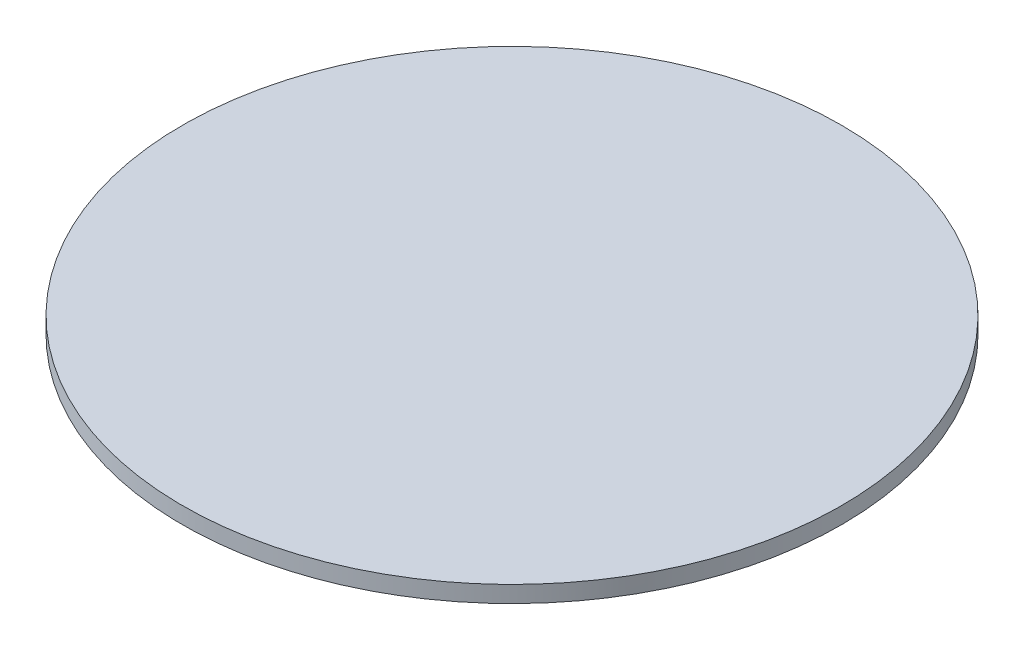
ISO-10303-21;
HEADER;
FILE_DESCRIPTION(('STEP AP214'),'2;1');
FILE_NAME('part.step','',(''),(''),'','','');
FILE_SCHEMA(('AUTOMOTIVE_DESIGN { 1 0 10303 214 1 1 1 1 }'));
ENDSEC;
DATA;
#1=APPLICATION_CONTEXT('core data for automotive mechanical design processes');
#2=APPLICATION_PROTOCOL_DEFINITION('international standard','automotive_design',2000,#1);
#3=PRODUCT_CONTEXT('',#1,'mechanical');
#4=PRODUCT('Part','Part','',(#3));
#5=PRODUCT_RELATED_PRODUCT_CATEGORY('part','',(#4));
#6=PRODUCT_DEFINITION_FORMATION('','',#4);
#7=PRODUCT_DEFINITION_CONTEXT('part definition',#1,'design');
#8=PRODUCT_DEFINITION('design','',#6,#7);
#9=PRODUCT_DEFINITION_SHAPE('','',#8);
#10=(LENGTH_UNIT() NAMED_UNIT(*) SI_UNIT(.MILLI.,.METRE.));
#11=(NAMED_UNIT(*) PLANE_ANGLE_UNIT() SI_UNIT($,.RADIAN.));
#12=(NAMED_UNIT(*) SI_UNIT($,.STERADIAN.) SOLID_ANGLE_UNIT());
#13=UNCERTAINTY_MEASURE_WITH_UNIT(LENGTH_MEASURE(1.E-05),#10,'distance_accuracy_value','');
#14=(GEOMETRIC_REPRESENTATION_CONTEXT(3) GLOBAL_UNCERTAINTY_ASSIGNED_CONTEXT((#13)) GLOBAL_UNIT_ASSIGNED_CONTEXT((#10,
#11,#12)) REPRESENTATION_CONTEXT('',''));
#15=CARTESIAN_POINT('',(0.,0.,0.));
#16=DIRECTION('',(0.,0.,1.));
#17=DIRECTION('',(1.,0.,0.));
#18=AXIS2_PLACEMENT_3D('',#15,#16,#17);
#19=CARTESIAN_POINT('',(21.2731332691048,3.24918533795985,48.3156163472091));
#20=CARTESIAN_POINT('',(22.5518425768475,3.24918533795985,48.3156163472091));
#21=CARTESIAN_POINT('',(25.1092611923328,3.24918533795985,48.5675000956199));
#22=CARTESIAN_POINT('',(28.7979688707965,3.24918533795985,49.6864573366789));
#23=CARTESIAN_POINT('',(32.1975013370636,3.24918533795985,51.5035452969249));
#24=CARTESIAN_POINT('',(35.1772164649353,3.24918533795985,53.9489343050804));
#25=CARTESIAN_POINT('',(37.6226054730908,3.24918533795985,56.9286494329521));
#26=CARTESIAN_POINT('',(39.4396934333368,3.24918533795985,60.3281818992191));
#27=CARTESIAN_POINT('',(40.5586506743957,3.24918533795985,64.0168895776828));
#28=CARTESIAN_POINT('',(40.9364762970121,3.24918533795985,67.8530175009108));
#29=CARTESIAN_POINT('',(40.5586506743957,3.24918533795985,71.6891454241388));
#30=CARTESIAN_POINT('',(39.4396934333368,3.24918533795985,75.3778531026025));
#31=CARTESIAN_POINT('',(37.6226054730908,3.24918533795985,78.7773855688696));
#32=CARTESIAN_POINT('',(35.1772164649353,3.24918533795985,81.7571006967413));
#33=CARTESIAN_POINT('',(32.1975013370636,3.24918533795985,84.2024897048968));
#34=CARTESIAN_POINT('',(28.7979688707965,3.24918533795985,86.0195776651428));
#35=CARTESIAN_POINT('',(25.1092611923329,3.24918533795985,87.1385349062017));
#36=CARTESIAN_POINT('',(21.2731332691048,3.24918533795985,87.516360528818));
#37=CARTESIAN_POINT('',(17.4370053458768,3.24918533795985,87.1385349062017));
#38=CARTESIAN_POINT('',(13.7482976674132,3.24918533795985,86.0195776651428));
#39=CARTESIAN_POINT('',(10.3487652011461,3.24918533795985,84.2024897048968));
#40=CARTESIAN_POINT('',(7.36905007327443,3.24918533795985,81.7571006967413));
#41=CARTESIAN_POINT('',(4.92366106511888,3.24918533795985,78.7773855688696));
#42=CARTESIAN_POINT('',(3.10657310487286,3.24918533795985,75.3778531026025));
#43=CARTESIAN_POINT('',(1.98761586381396,3.24918533795985,71.6891454241389));
#44=CARTESIAN_POINT('',(1.60979024119762,3.24918533795985,67.8530175009108));
#45=CARTESIAN_POINT('',(1.98761586381396,3.24918533795985,64.0168895776828));
#46=CARTESIAN_POINT('',(3.10657310487286,3.24918533795985,60.3281818992191));
#47=CARTESIAN_POINT('',(4.92366106511886,3.24918533795985,56.9286494329521));
#48=CARTESIAN_POINT('',(7.36905007327443,3.24918533795985,53.9489343050804));
#49=CARTESIAN_POINT('',(10.3487652011461,3.24918533795985,51.5035452969249));
#50=CARTESIAN_POINT('',(13.7482976674132,3.24918533795985,49.6864573366789));
#51=CARTESIAN_POINT('',(17.4370053458768,3.24918533795985,48.56750009562));
#52=CARTESIAN_POINT('',(19.9944239613622,3.24918533795985,48.3156163472091));
#53=CARTESIAN_POINT('',(21.2731332691048,3.24918533795985,48.3156163472091));
#54=B_SPLINE_CURVE_WITH_KNOTS('',3,(#19,#20,#21,#22,#23,#24,#25,#26,#27,#28,#29,#30,#31,#32,#33,
#34,#35,#36,#37,#38,#39,#40,#41,#42,#43,#44,#45,#46,#47,#48,#49,#50,#51,#52,#53),.UNSPECIFIED.,
.T.,.F.,(4,1,1,1,1,1,1,1,1,1,1,1,1,1,1,1,1,1,1,1,1,1,1,1,1,1,1,1,1,1,1,1,4),(0.,0.03125,0.0625,
0.09375,0.125,0.15625,0.1875,0.21875,0.25,0.28125,0.3125,0.34375,0.375,0.40625,0.4375,0.46875,
0.5,0.53125,0.5625,0.59375,0.625,0.65625,0.6875,0.71875,0.75,0.78125,0.8125,0.84375,0.875,
0.90625,0.9375,0.96875,1.),.UNSPECIFIED.);
#55=DIRECTION('',(0.,-1.,0.));
#56=VECTOR('',#55,1.);
#57=SURFACE_OF_LINEAR_EXTRUSION('',#54,#56);
#58=CARTESIAN_POINT('',(21.2731332691048,3.24918533795985,48.3156163472091));
#59=CARTESIAN_POINT('',(22.5518425768475,3.24918533795985,48.3156163472091));
#60=CARTESIAN_POINT('',(25.1092611923328,3.24918533795985,48.5675000956199));
#61=CARTESIAN_POINT('',(28.7979688707965,3.24918533795985,49.6864573366789));
#62=CARTESIAN_POINT('',(32.1975013370636,3.24918533795985,51.5035452969249));
#63=CARTESIAN_POINT('',(35.1772164649353,3.24918533795985,53.9489343050804));
#64=CARTESIAN_POINT('',(37.6226054730908,3.24918533795985,56.9286494329521));
#65=CARTESIAN_POINT('',(39.4396934333368,3.24918533795985,60.3281818992191));
#66=CARTESIAN_POINT('',(40.5586506743957,3.24918533795985,64.0168895776828));
#67=CARTESIAN_POINT('',(40.9364762970121,3.24918533795985,67.8530175009108));
#68=CARTESIAN_POINT('',(40.5586506743957,3.24918533795985,71.6891454241388));
#69=CARTESIAN_POINT('',(39.4396934333368,3.24918533795985,75.3778531026025));
#70=CARTESIAN_POINT('',(37.6226054730908,3.24918533795985,78.7773855688696));
#71=CARTESIAN_POINT('',(35.1772164649353,3.24918533795985,81.7571006967413));
#72=CARTESIAN_POINT('',(32.1975013370636,3.24918533795985,84.2024897048968));
#73=CARTESIAN_POINT('',(28.7979688707965,3.24918533795985,86.0195776651428));
#74=CARTESIAN_POINT('',(25.1092611923329,3.24918533795985,87.1385349062017));
#75=CARTESIAN_POINT('',(21.2731332691048,3.24918533795985,87.516360528818));
#76=CARTESIAN_POINT('',(17.4370053458768,3.24918533795985,87.1385349062017));
#77=CARTESIAN_POINT('',(13.7482976674132,3.24918533795985,86.0195776651428));
#78=CARTESIAN_POINT('',(10.3487652011461,3.24918533795985,84.2024897048968));
#79=CARTESIAN_POINT('',(7.36905007327443,3.24918533795985,81.7571006967413));
#80=CARTESIAN_POINT('',(4.92366106511888,3.24918533795985,78.7773855688696));
#81=CARTESIAN_POINT('',(3.10657310487286,3.24918533795985,75.3778531026025));
#82=CARTESIAN_POINT('',(1.98761586381396,3.24918533795985,71.6891454241389));
#83=CARTESIAN_POINT('',(1.60979024119762,3.24918533795985,67.8530175009108));
#84=CARTESIAN_POINT('',(1.98761586381396,3.24918533795985,64.0168895776828));
#85=CARTESIAN_POINT('',(3.10657310487286,3.24918533795985,60.3281818992191));
#86=CARTESIAN_POINT('',(4.92366106511886,3.24918533795985,56.9286494329521));
#87=CARTESIAN_POINT('',(7.36905007327443,3.24918533795985,53.9489343050804));
#88=CARTESIAN_POINT('',(10.3487652011461,3.24918533795985,51.5035452969249));
#89=CARTESIAN_POINT('',(13.7482976674132,3.24918533795985,49.6864573366789));
#90=CARTESIAN_POINT('',(17.4370053458768,3.24918533795985,48.56750009562));
#91=CARTESIAN_POINT('',(19.9944239613622,3.24918533795985,48.3156163472091));
#92=CARTESIAN_POINT('',(21.2731332691048,3.24918533795985,48.3156163472091));
#93=B_SPLINE_CURVE_WITH_KNOTS('',3,(#58,#59,#60,#61,#62,#63,#64,#65,#66,#67,#68,#69,#70,#71,#72,
#73,#74,#75,#76,#77,#78,#79,#80,#81,#82,#83,#84,#85,#86,#87,#88,#89,#90,#91,#92),.UNSPECIFIED.,
.T.,.F.,(4,1,1,1,1,1,1,1,1,1,1,1,1,1,1,1,1,1,1,1,1,1,1,1,1,1,1,1,1,1,1,1,4),(0.,0.03125,0.0625,
0.09375,0.125,0.15625,0.1875,0.21875,0.25,0.28125,0.3125,0.34375,0.375,0.40625,0.4375,0.46875,
0.5,0.53125,0.5625,0.59375,0.625,0.65625,0.6875,0.71875,0.75,0.78125,0.8125,0.84375,0.875,
0.90625,0.9375,0.96875,1.),.UNSPECIFIED.);
#94=CARTESIAN_POINT('',(21.2731332691048,3.24918533795985,48.3156163472091));
#95=VERTEX_POINT('',#94);
#96=EDGE_CURVE('E9',#95,#95,#93,.T.);
#97=ORIENTED_EDGE('',*,*,#96,.T.);
#98=EDGE_LOOP('',(#97));
#99=FACE_BOUND('',#98,.T.);
#100=CARTESIAN_POINT('',(21.2731332691048,2.26610024094685,48.3156163472091));
#101=CARTESIAN_POINT('',(20.9534539792347,2.26610024094685,48.3156164135175));
#102=CARTESIAN_POINT('',(20.6337770159498,2.26610024094685,48.3234878083506));
#103=CARTESIAN_POINT('',(19.9951908941976,2.26610024094685,48.3548975878318));
#104=CARTESIAN_POINT('',(19.6762817417138,2.26610024094685,48.3784360941787));
#105=CARTESIAN_POINT('',(19.0399993834664,2.26610024094685,48.441104427098));
#106=CARTESIAN_POINT('',(18.7226261777028,2.26610024094685,48.4802342536703));
#107=CARTESIAN_POINT('',(18.0901819039535,2.26610024094685,48.5740100794553));
#108=CARTESIAN_POINT('',(17.7751108181044,2.26610024094685,48.6286559581387));
#109=CARTESIAN_POINT('',(17.1480399552374,2.26610024094685,48.7533881059154));
#110=CARTESIAN_POINT('',(16.8360401782195,2.26610024094685,48.8234743750086));
#111=CARTESIAN_POINT('',(16.2158513583498,2.26610024094685,48.9788627716175));
#112=CARTESIAN_POINT('',(15.9076623451182,2.26610024094685,49.064165017324));
#113=CARTESIAN_POINT('',(15.2958321455452,2.26610024094685,49.2497616790427));
#114=CARTESIAN_POINT('',(14.9921909592038,2.26610024094685,49.350056095055));
#115=CARTESIAN_POINT('',(14.3901936309591,2.26610024094685,49.5654138142376));
#116=CARTESIAN_POINT('',(14.0918374480209,2.26610024094685,49.6804770026796));
#117=CARTESIAN_POINT('',(13.5011496242043,2.26610024094685,49.9251479104071));
#118=CARTESIAN_POINT('',(13.2088179833259,2.26610024094685,50.0547556296925));
#119=CARTESIAN_POINT('',(12.6308606864745,2.26610024094685,50.3281511193137));
#120=CARTESIAN_POINT('',(12.3452350826105,2.26610024094685,50.4719389997908));
#121=CARTESIAN_POINT('',(11.7813691422234,2.26610024094685,50.7733316241086));
#122=CARTESIAN_POINT('',(11.5031288057003,2.26610024094685,50.9309363679493));
#123=CARTESIAN_POINT('',(10.9547128938425,2.26610024094685,51.2595999016297));
#124=CARTESIAN_POINT('',(10.6845372558789,2.26610024094685,51.4306585869511));
#125=CARTESIAN_POINT('',(10.1529322592117,2.26610024094685,51.7858656895351));
#126=CARTESIAN_POINT('',(9.89150290050792,2.26610024094685,51.9700141067977));
#127=CARTESIAN_POINT('',(9.37798770514394,2.26610024094685,52.3509102539058));
#128=CARTESIAN_POINT('',(9.1259019410789,2.26610024094685,52.5476580816103));
#129=CARTESIAN_POINT('',(8.6316693107629,2.26610024094685,52.9532643190461));
#130=CARTESIAN_POINT('',(8.38952244451194,2.26610024094685,53.1621227287774));
#131=CARTESIAN_POINT('',(7.91576326524225,2.26610024094685,53.5914617216599));
#132=CARTESIAN_POINT('',(7.68415087040754,2.26610024094685,53.8119422145194));
#133=CARTESIAN_POINT('',(7.23205798271334,2.26610024094685,54.2640351022136));
#134=CARTESIAN_POINT('',(7.01157748985384,2.26610024094685,54.4956474970483));
#135=CARTESIAN_POINT('',(6.58223849697139,2.26610024094685,54.969406676318));
#136=CARTESIAN_POINT('',(6.37338008724007,2.26610024094685,55.2115535425689));
#137=CARTESIAN_POINT('',(5.96777384980429,2.26610024094685,55.7057861728849));
#138=CARTESIAN_POINT('',(5.77102602209982,2.26610024094685,55.9578719369499));
#139=CARTESIAN_POINT('',(5.3901298749917,2.26610024094685,56.471387132314));
#140=CARTESIAN_POINT('',(5.20598145772912,2.26610024094685,56.7328164910179));
#141=CARTESIAN_POINT('',(4.85077435514512,2.26610024094685,57.2644214876848));
#142=CARTESIAN_POINT('',(4.67971566982371,2.26610024094685,57.5345971256478));
#143=CARTESIAN_POINT('',(4.35105213614327,2.26610024094685,58.083013037507));
#144=CARTESIAN_POINT('',(4.19344739230247,2.26610024094685,58.361253374032));
#145=CARTESIAN_POINT('',(3.89205476798494,2.26610024094685,58.9251193144139));
#146=CARTESIAN_POINT('',(3.74826688750821,2.26610024094685,59.2107449182709));
#147=CARTESIAN_POINT('',(3.47487139788603,2.26610024094685,59.7887022151414));
#148=CARTESIAN_POINT('',(3.34526367859934,2.26610024094685,60.081033856046));
#149=CARTESIAN_POINT('',(3.10059277087541,2.26610024094685,60.6717216797912));
#150=CARTESIAN_POINT('',(2.98552958243816,2.26610024094685,60.9700778626319));
#151=CARTESIAN_POINT('',(2.77017186324245,2.26610024094685,61.572075191143));
#152=CARTESIAN_POINT('',(2.66987744721221,2.26610024094685,61.8757163778483));
#153=CARTESIAN_POINT('',(2.48428078554252,2.26610024094685,62.4875465764271));
#154=CARTESIAN_POINT('',(2.39897853990307,2.26610024094685,62.7957355883005));
#155=CARTESIAN_POINT('',(2.24359014311103,2.26610024094685,63.4159244118809));
#156=CARTESIAN_POINT('',(2.17350387376759,2.26610024094685,63.7279241939676));
#157=CARTESIAN_POINT('',(2.04877172667452,2.26610024094685,64.3549950429862));
#158=CARTESIAN_POINT('',(1.99412584892491,2.26610024094685,64.6700661099181));
#159=CARTESIAN_POINT('',(1.90035002058861,2.26610024094685,65.3025104353503));
#160=CARTESIAN_POINT('',(1.8612201905312,2.26610024094685,65.6198837117148));
#161=CARTESIAN_POINT('',(1.79855186713351,2.26610024094685,66.2561658770773));
#162=CARTESIAN_POINT('',(1.77501337379323,2.26610024094685,66.5750747660753));
#163=CARTESIAN_POINT('',(1.74360355877724,2.26610024094685,67.2136616076813));
#164=CARTESIAN_POINT('',(1.73573211540307,2.26610024094685,67.533339554296));
#165=CARTESIAN_POINT('',(1.73573211540306,2.26610024094685,68.1726954475256));
#166=CARTESIAN_POINT('',(1.74360355877724,2.26610024094685,68.4923733941404));
#167=CARTESIAN_POINT('',(1.77501337379323,2.26610024094685,69.1309602357463));
#168=CARTESIAN_POINT('',(1.79855186713351,2.26610024094685,69.4498691247443));
#169=CARTESIAN_POINT('',(1.8612201905312,2.26610024094685,70.0861512901068));
#170=CARTESIAN_POINT('',(1.9003500205886,2.26610024094685,70.4035245664713));
#171=CARTESIAN_POINT('',(1.9941258489249,2.26610024094685,71.0359688919036));
#172=CARTESIAN_POINT('',(2.04877172667452,2.26610024094685,71.3510399588355));
#173=CARTESIAN_POINT('',(2.17350387376758,2.26610024094685,71.9781108078541));
#174=CARTESIAN_POINT('',(2.24359014311103,2.26610024094685,72.2901105899408));
#175=CARTESIAN_POINT('',(2.39897853990307,2.26610024094685,72.9102994135212));
#176=CARTESIAN_POINT('',(2.48428078554251,2.26610024094685,73.2184884253946));
#177=CARTESIAN_POINT('',(2.6698774472122,2.26610024094685,73.8303186239734));
#178=CARTESIAN_POINT('',(2.77017186324245,2.26610024094685,74.1339598106787));
#179=CARTESIAN_POINT('',(2.98552958243816,2.26610024094685,74.7359571391898));
#180=CARTESIAN_POINT('',(3.10059277087541,2.26610024094685,75.0343133220305));
#181=CARTESIAN_POINT('',(3.34526367859934,2.26610024094685,75.6250011457757));
#182=CARTESIAN_POINT('',(3.47487139788603,2.26610024094685,75.9173327866803));
#183=CARTESIAN_POINT('',(3.74826688750822,2.26610024094685,76.4952900835508));
#184=CARTESIAN_POINT('',(3.89205476798495,2.26610024094685,76.7809156874078));
#185=CARTESIAN_POINT('',(4.19344739230248,2.26610024094685,77.3447816277897));
#186=CARTESIAN_POINT('',(4.35105213614328,2.26610024094685,77.6230219643147));
#187=CARTESIAN_POINT('',(4.67971566982371,2.26610024094685,78.1714378761739));
#188=CARTESIAN_POINT('',(4.85077435514513,2.26610024094685,78.4416135141369));
#189=CARTESIAN_POINT('',(5.20598145772913,2.26610024094685,78.9732185108038));
#190=CARTESIAN_POINT('',(5.39012987499171,2.26610024094685,79.2346478695077));
#191=CARTESIAN_POINT('',(5.77102602209982,2.26610024094685,79.7481630648718));
#192=CARTESIAN_POINT('',(5.96777384980429,2.26610024094685,80.0002488289368));
#193=CARTESIAN_POINT('',(6.37338008724007,2.26610024094685,80.4944814592528));
#194=CARTESIAN_POINT('',(6.58223849697139,2.26610024094685,80.7366283255038));
#195=CARTESIAN_POINT('',(7.01157748985384,2.26610024094685,81.2103875047735));
#196=CARTESIAN_POINT('',(7.23205798271334,2.26610024094685,81.4419998996081));
#197=CARTESIAN_POINT('',(7.68415087040753,2.26610024094685,81.8940927873024));
#198=CARTESIAN_POINT('',(7.91576326524224,2.26610024094685,82.1145732801619));
#199=CARTESIAN_POINT('',(8.38952244451193,2.26610024094685,82.5439122730443));
#200=CARTESIAN_POINT('',(8.63166931076291,2.26610024094685,82.7527706827756));
#201=CARTESIAN_POINT('',(9.12590194107888,2.26610024094685,83.1583769202114));
#202=CARTESIAN_POINT('',(9.37798770514388,2.26610024094685,83.3551247479159));
#203=CARTESIAN_POINT('',(9.89150290050796,2.26610024094685,83.736020895024));
#204=CARTESIAN_POINT('',(10.1529322592118,2.26610024094685,83.9201693122865));
#205=CARTESIAN_POINT('',(10.6845372558788,2.26610024094685,84.2753764148705));
#206=CARTESIAN_POINT('',(10.9547128938418,2.26610024094684,84.446435100192));
#207=CARTESIAN_POINT('',(11.503128805701,2.26610024094684,84.7750986338724));
#208=CARTESIAN_POINT('',(11.7813691422259,2.26610024094685,84.9327033777132));
#209=CARTESIAN_POINT('',(12.3452350826079,2.26610024094685,85.2340960020307));
#210=CARTESIAN_POINT('',(12.6308606864649,2.26610024094685,85.3778838825075));
#211=CARTESIAN_POINT('',(13.2088179833354,2.26610024094685,85.6512793721297));
#212=CARTESIAN_POINT('',(13.5011496242399,2.26610024094685,85.7808870914163));
#213=CARTESIAN_POINT('',(14.0918374479852,2.26610024094685,86.0255579991403));
#214=CARTESIAN_POINT('',(14.3901936308259,2.26610024094684,86.1406211875775));
#215=CARTESIAN_POINT('',(14.992190959337,2.26610024094684,86.3559789067732));
#216=CARTESIAN_POINT('',(15.2958321460423,2.26610024094684,86.4562733228035));
#217=CARTESIAN_POINT('',(15.907662344621,2.26610024094684,86.6418699844732));
#218=CARTESIAN_POINT('',(16.2158513564945,2.26610024094684,86.7271722301126));
#219=CARTESIAN_POINT('',(16.8360401800749,2.26610024094684,86.8825606269047));
#220=CARTESIAN_POINT('',(17.1480399621616,2.26610024094684,86.9526468962481));
#221=CARTESIAN_POINT('',(17.7751108111802,2.26610024094684,87.0773790433412));
#222=CARTESIAN_POINT('',(18.0901818781121,2.26610024094684,87.1320249210908));
#223=CARTESIAN_POINT('',(18.7226262035443,2.26610024094684,87.2258007494271));
#224=CARTESIAN_POINT('',(19.0399994799088,2.26610024094684,87.2649305794845));
#225=CARTESIAN_POINT('',(19.6762816452713,2.26610024094684,87.3275989028822));
#226=CARTESIAN_POINT('',(19.9951905342693,2.26610024094685,87.3511373962225));
#227=CARTESIAN_POINT('',(20.6337773758753,2.26610024094685,87.3825472112384));
#228=CARTESIAN_POINT('',(20.95345532249,2.26610024094684,87.3904186546126));
#229=CARTESIAN_POINT('',(21.5928112157196,2.26610024094684,87.3904186546126));
#230=CARTESIAN_POINT('',(21.9124891623344,2.26610024094684,87.3825472112384));
#231=CARTESIAN_POINT('',(22.5510760039403,2.26610024094684,87.3511373962225));
#232=CARTESIAN_POINT('',(22.8699848929383,2.26610024094684,87.3275989028822));
#233=CARTESIAN_POINT('',(23.5062670583008,2.26610024094684,87.2649305794845));
#234=CARTESIAN_POINT('',(23.8236403346653,2.26610024094684,87.2258007494271));
#235=CARTESIAN_POINT('',(24.4560846600976,2.26610024094684,87.1320249210908));
#236=CARTESIAN_POINT('',(24.7711557270295,2.26610024094684,87.0773790433412));
#237=CARTESIAN_POINT('',(25.3982265760481,2.26610024094684,86.9526468962481));
#238=CARTESIAN_POINT('',(25.7102263581348,2.26610024094684,86.8825606269046));
#239=CARTESIAN_POINT('',(26.3304151817152,2.26610024094684,86.7271722301126));
#240=CARTESIAN_POINT('',(26.6386041935886,2.26610024094684,86.6418699844732));
#241=CARTESIAN_POINT('',(27.2504343921674,2.26610024094684,86.4562733228035));
#242=CARTESIAN_POINT('',(27.5540755788727,2.26610024094685,86.3559789067732));
#243=CARTESIAN_POINT('',(28.1560729073837,2.26610024094685,86.1406211875775));
#244=CARTESIAN_POINT('',(28.4544290902245,2.26610024094685,86.0255579991403));
#245=CARTESIAN_POINT('',(29.0451169139697,2.26610024094685,85.7808870914164));
#246=CARTESIAN_POINT('',(29.3374485548742,2.26610024094685,85.6512793721297));
#247=CARTESIAN_POINT('',(29.9154058517448,2.26610024094685,85.3778838825075));
#248=CARTESIAN_POINT('',(30.2010314556017,2.26610024094685,85.2340960020307));
#249=CARTESIAN_POINT('',(30.7648973959837,2.26610024094684,84.9327033777132));
#250=CARTESIAN_POINT('',(31.0431377325087,2.26610024094684,84.7750986338724));
#251=CARTESIAN_POINT('',(31.5915536443679,2.26610024094684,84.446435100192));
#252=CARTESIAN_POINT('',(31.8617292823309,2.26610024094684,84.2753764148705));
#253=CARTESIAN_POINT('',(32.3933342789978,2.26610024094684,83.9201693122866));
#254=CARTESIAN_POINT('',(32.6547636377017,2.26610024094684,83.736020895024));
#255=CARTESIAN_POINT('',(33.1682788330658,2.26610024094684,83.3551247479159));
#256=CARTESIAN_POINT('',(33.4203645971308,2.26610024094684,83.1583769202114));
#257=CARTESIAN_POINT('',(33.9145972274468,2.26610024094685,82.7527706827756));
#258=CARTESIAN_POINT('',(34.1567440936977,2.26610024094685,82.5439122730443));
#259=CARTESIAN_POINT('',(34.6305032729674,2.26610024094685,82.1145732801618));
#260=CARTESIAN_POINT('',(34.8621156678021,2.26610024094684,81.8940927873024));
#261=CARTESIAN_POINT('',(35.3142085554963,2.26610024094684,81.4419998996081));
#262=CARTESIAN_POINT('',(35.5346890483558,2.26610024094685,81.2103875047735));
#263=CARTESIAN_POINT('',(35.9640280412383,2.26610024094685,80.7366283255038));
#264=CARTESIAN_POINT('',(36.1728864509696,2.26610024094685,80.4944814592528));
#265=CARTESIAN_POINT('',(36.5784926884054,2.26610024094684,80.0002488289368));
#266=CARTESIAN_POINT('',(36.7752405161098,2.26610024094684,79.7481630648718));
#267=CARTESIAN_POINT('',(37.156136663218,2.26610024094684,79.2346478695077));
#268=CARTESIAN_POINT('',(37.3402850804805,2.26610024094684,78.9732185108039));
#269=CARTESIAN_POINT('',(37.6954921830645,2.26610024094684,78.4416135141369));
#270=CARTESIAN_POINT('',(37.866550868386,2.26610024094685,78.1714378761739));
#271=CARTESIAN_POINT('',(38.1952144020664,2.26610024094685,77.6230219643147));
#272=CARTESIAN_POINT('',(38.3528191459072,2.26610024094685,77.3447816277898));
#273=CARTESIAN_POINT('',(38.6542117702247,2.26610024094685,76.7809156874078));
#274=CARTESIAN_POINT('',(38.7979996507015,2.26610024094685,76.4952900835508));
#275=CARTESIAN_POINT('',(39.0713951403237,2.26610024094685,75.9173327866803));
#276=CARTESIAN_POINT('',(39.2010028596104,2.26610024094685,75.6250011457758));
#277=CARTESIAN_POINT('',(39.4456737673343,2.26610024094685,75.0343133220305));
#278=CARTESIAN_POINT('',(39.5607369557715,2.26610024094685,74.7359571391898));
#279=CARTESIAN_POINT('',(39.7760946749672,2.26610024094685,74.1339598106787));
#280=CARTESIAN_POINT('',(39.8763890909975,2.26610024094685,73.8303186239734));
#281=CARTESIAN_POINT('',(40.0619857526672,2.26610024094685,73.2184884253946));
#282=CARTESIAN_POINT('',(40.1472879983066,2.26610024094685,72.9102994135212));
#283=CARTESIAN_POINT('',(40.3026763950987,2.26610024094685,72.2901105899408));
#284=CARTESIAN_POINT('',(40.3727626644421,2.26610024094685,71.9781108078541));
#285=CARTESIAN_POINT('',(40.4974948115352,2.26610024094685,71.3510399588355));
#286=CARTESIAN_POINT('',(40.5521406892848,2.26610024094685,71.0359688919036));
#287=CARTESIAN_POINT('',(40.6459165176211,2.26610024094685,70.4035245664713));
#288=CARTESIAN_POINT('',(40.6850463476785,2.26610024094685,70.0861512901068));
#289=CARTESIAN_POINT('',(40.7477146710762,2.26610024094685,69.4498691247444));
#290=CARTESIAN_POINT('',(40.7712531644165,2.26610024094685,69.1309602357464));
#291=CARTESIAN_POINT('',(40.8026629794325,2.26610024094685,68.4923733941404));
#292=CARTESIAN_POINT('',(40.8105344228066,2.26610024094685,68.1726954475256));
#293=CARTESIAN_POINT('',(40.8105344228066,2.26610024094685,67.5333395542961));
#294=CARTESIAN_POINT('',(40.8026629794324,2.26610024094685,67.2136616076813));
#295=CARTESIAN_POINT('',(40.7712531644165,2.26610024094685,66.5750747660753));
#296=CARTESIAN_POINT('',(40.7477146710762,2.26610024094685,66.2561658770774));
#297=CARTESIAN_POINT('',(40.6850463476785,2.26610024094685,65.6198837117149));
#298=CARTESIAN_POINT('',(40.6459165176211,2.26610024094685,65.3025104353503));
#299=CARTESIAN_POINT('',(40.5521406892848,2.26610024094685,64.6700661099181));
#300=CARTESIAN_POINT('',(40.4974948115352,2.26610024094685,64.3549950429862));
#301=CARTESIAN_POINT('',(40.3727626644421,2.26610024094685,63.7279241939676));
#302=CARTESIAN_POINT('',(40.3026763950987,2.26610024094685,63.4159244118809));
#303=CARTESIAN_POINT('',(40.1472879983066,2.26610024094685,62.7957355883005));
#304=CARTESIAN_POINT('',(40.0619857526672,2.26610024094685,62.4875465764271));
#305=CARTESIAN_POINT('',(39.8763890909975,2.26610024094685,61.8757163778483));
#306=CARTESIAN_POINT('',(39.7760946749672,2.26610024094685,61.572075191143));
#307=CARTESIAN_POINT('',(39.5607369557715,2.26610024094685,60.9700778626319));
#308=CARTESIAN_POINT('',(39.4456737673343,2.26610024094685,60.6717216797912));
#309=CARTESIAN_POINT('',(39.2010028596104,2.26610024094685,60.081033856046));
#310=CARTESIAN_POINT('',(39.0713951403237,2.26610024094685,59.7887022151414));
#311=CARTESIAN_POINT('',(38.7979996507015,2.26610024094685,59.2107449182709));
#312=CARTESIAN_POINT('',(38.6542117702247,2.26610024094685,58.9251193144139));
#313=CARTESIAN_POINT('',(38.3528191459072,2.26610024094685,58.361253374032));
#314=CARTESIAN_POINT('',(38.1952144020664,2.26610024094685,58.083013037507));
#315=CARTESIAN_POINT('',(37.866550868386,2.26610024094685,57.5345971256478));
#316=CARTESIAN_POINT('',(37.6954921830646,2.26610024094685,57.2644214876848));
#317=CARTESIAN_POINT('',(37.3402850804806,2.26610024094685,56.7328164910179));
#318=CARTESIAN_POINT('',(37.156136663218,2.26610024094685,56.471387132314));
#319=CARTESIAN_POINT('',(36.7752405161099,2.26610024094685,55.9578719369499));
#320=CARTESIAN_POINT('',(36.5784926884054,2.26610024094685,55.7057861728849));
#321=CARTESIAN_POINT('',(36.1728864509696,2.26610024094685,55.2115535425689));
#322=CARTESIAN_POINT('',(35.9640280412383,2.26610024094685,54.9694066763179));
#323=CARTESIAN_POINT('',(35.5346890483559,2.26610024094685,54.4956474970483));
#324=CARTESIAN_POINT('',(35.3142085554964,2.26610024094685,54.2640351022136));
#325=CARTESIAN_POINT('',(34.8621156678022,2.26610024094685,53.8119422145193));
#326=CARTESIAN_POINT('',(34.6305032729674,2.26610024094685,53.5914617216598));
#327=CARTESIAN_POINT('',(34.1567440936978,2.26610024094685,53.1621227287774));
#328=CARTESIAN_POINT('',(33.9145972274468,2.26610024094685,52.9532643190461));
#329=CARTESIAN_POINT('',(33.4203645971308,2.26610024094685,52.5476580816103));
#330=CARTESIAN_POINT('',(33.1682788330657,2.26610024094685,52.3509102539058));
#331=CARTESIAN_POINT('',(32.6547636377018,2.26610024094685,51.9700141067977));
#332=CARTESIAN_POINT('',(32.393334278998,2.26610024094685,51.7858656895351));
#333=CARTESIAN_POINT('',(31.8617292823307,2.26610024094685,51.4306585869511));
#334=CARTESIAN_POINT('',(31.5915536443672,2.26610024094685,51.2595999016297));
#335=CARTESIAN_POINT('',(31.0431377325094,2.26610024094685,50.9309363679493));
#336=CARTESIAN_POINT('',(30.7648973959863,2.26610024094685,50.7733316241086));
#337=CARTESIAN_POINT('',(30.2010314555992,2.26610024094685,50.4719389997908));
#338=CARTESIAN_POINT('',(29.9154058517352,2.26610024094685,50.3281511193137));
#339=CARTESIAN_POINT('',(29.3374485548838,2.26610024094685,50.0547556296925));
#340=CARTESIAN_POINT('',(29.0451169140054,2.26610024094685,49.9251479104071));
#341=CARTESIAN_POINT('',(28.4544290901888,2.26610024094685,49.6804770026796));
#342=CARTESIAN_POINT('',(28.1560729072505,2.26610024094685,49.5654138142376));
#343=CARTESIAN_POINT('',(27.5540755790059,2.26610024094685,49.350056095055));
#344=CARTESIAN_POINT('',(27.2504343926645,2.26610024094685,49.2497616790427));
#345=CARTESIAN_POINT('',(26.6386041930915,2.26610024094685,49.064165017324));
#346=CARTESIAN_POINT('',(26.3304151798598,2.26610024094685,48.9788627716175));
#347=CARTESIAN_POINT('',(25.7102263599901,2.26610024094685,48.8234743750086));
#348=CARTESIAN_POINT('',(25.3982265829723,2.26610024094685,48.7533881059154));
#349=CARTESIAN_POINT('',(24.7711557201053,2.26610024094685,48.6286559581387));
#350=CARTESIAN_POINT('',(24.4560846342562,2.26610024094685,48.5740100794553));
#351=CARTESIAN_POINT('',(23.8236403605069,2.26610024094685,48.4802342536702));
#352=CARTESIAN_POINT('',(23.5062671547433,2.26610024094685,48.441104427098));
#353=CARTESIAN_POINT('',(22.8699847964959,2.26610024094685,48.3784360941787));
#354=CARTESIAN_POINT('',(22.5510756440121,2.26610024094685,48.3548975878318));
#355=CARTESIAN_POINT('',(21.9124895222599,2.26610024094685,48.3234878083506));
#356=CARTESIAN_POINT('',(21.592812558975,2.26610024094685,48.3156164135175));
#357=CARTESIAN_POINT('',(21.2731332691048,2.26610024094685,48.3156163472091));
#358=B_SPLINE_CURVE_WITH_KNOTS('',3,(#100,#101,#102,#103,#104,#105,#106,#107,#108,#109,#110,
#111,#112,#113,#114,#115,#116,#117,#118,#119,#120,#121,#122,#123,#124,#125,#126,#127,#128,#129,
#130,#131,#132,#133,#134,#135,#136,#137,#138,#139,#140,#141,#142,#143,#144,#145,#146,#147,#148,
#149,#150,#151,#152,#153,#154,#155,#156,#157,#158,#159,#160,#161,#162,#163,#164,#165,#166,#167,
#168,#169,#170,#171,#172,#173,#174,#175,#176,#177,#178,#179,#180,#181,#182,#183,#184,#185,#186,
#187,#188,#189,#190,#191,#192,#193,#194,#195,#196,#197,#198,#199,#200,#201,#202,#203,#204,#205,
#206,#207,#208,#209,#210,#211,#212,#213,#214,#215,#216,#217,#218,#219,#220,#221,#222,#223,#224,
#225,#226,#227,#228,#229,#230,#231,#232,#233,#234,#235,#236,#237,#238,#239,#240,#241,#242,#243,
#244,#245,#246,#247,#248,#249,#250,#251,#252,#253,#254,#255,#256,#257,#258,#259,#260,#261,#262,
#263,#264,#265,#266,#267,#268,#269,#270,#271,#272,#273,#274,#275,#276,#277,#278,#279,#280,#281,
#282,#283,#284,#285,#286,#287,#288,#289,#290,#291,#292,#293,#294,#295,#296,#297,#298,#299,#300,
#301,#302,#303,#304,#305,#306,#307,#308,#309,#310,#311,#312,#313,#314,#315,#316,#317,#318,#319,
#320,#321,#322,#323,#324,#325,#326,#327,#328,#329,#330,#331,#332,#333,#334,#335,#336,#337,#338,
#339,#340,#341,#342,#343,#344,#345,#346,#347,#348,#349,#350,#351,#352,#353,#354,#355,#356,#357),
.UNSPECIFIED.,.F.,.F.,(4,2,2,2,2,2,2,2,2,2,2,2,2,2,2,2,2,2,2,2,2,2,2,2,2,2,2,2,2,2,2,2,2,2,2,2,
2,2,2,2,2,2,2,2,2,2,2,2,2,2,2,2,2,2,2,2,2,2,2,2,2,2,2,2,2,2,2,2,2,2,2,2,2,2,2,2,2,2,2,2,2,2,2,2,
2,2,2,2,2,2,2,2,2,2,2,2,2,2,2,2,2,2,2,2,2,2,2,2,2,2,2,2,2,2,2,2,2,2,2,2,2,2,2,2,2,2,2,2,4),(0.,
0.958937939115206,1.91788332715285,2.87682871519049,3.83576665430569,4.79470459342089,
5.75364998145852,6.71259536949616,7.67153330861136,8.63047124772657,9.5894166357642,
10.5483620238018,11.507299962917,12.4662379020323,13.4251832900699,14.3841286781075,
15.3430666172227,16.3020045563379,17.2609499443756,18.2198953324132,19.1788332715284,
20.1377712106436,21.0967165986813,22.0556619867189,23.0145999258341,23.9735378649493,
24.9324832529869,25.8914286410246,26.8503665801398,27.809304519255,28.7682499072926,
29.7271952953302,30.6861332344454,31.6450711735606,32.6040165615983,33.5629619496359,
34.5218998887511,35.4808378278663,36.439783215904,37.3987286039416,38.3576665430568,
39.316604482172,40.2755498702096,41.2344952582473,42.1934331973625,43.1523711364777,
44.1113165245153,45.070261912553,46.0291998516682,46.9881377907834,47.947083178821,
48.9060285668587,49.8649665059738,50.8239044450891,51.7828498331267,52.7417952211643,
53.7007331602795,54.6596710993947,55.6186164874324,56.57756187547,57.5364998145852,
58.4954377537004,59.454383141738,60.4133285297757,61.3722664688909,62.3312044080061,
63.2901497960437,64.2490951840814,65.2080331231966,66.1669710623118,67.1259164503494,
68.0848618383871,69.0437997775023,70.0027377166175,70.9616831046551,71.9206284926927,
72.8795664318079,73.8385043709231,74.7974497589608,75.7563951469984,76.7153330861136,
77.6742710252288,78.6332164132665,79.5921618013041,80.5510997404193,81.5100376795345,
82.4689830675721,83.4279284556098,84.386866394725,85.3458043338402,86.3047497218778,
87.2636951099155,88.2226330490306,89.1815709881459,90.1405163761835,91.0994617642211,
92.0583997033363,93.0173376424515,93.9762830304892,94.9352284185268,95.894166357642,
96.8531042967572,97.8120496847949,98.7709950728325,99.7299330119477,100.688870951063,
101.647816339101,102.606761727138,103.565699666253,104.524637605369,105.483582993406,
106.442528381444,107.401466320559,108.360404259674,109.319349647712,110.27829503575,
111.237232974865,112.19617091398,113.155116302018,114.114061690055,115.07299962917,
116.031937568286,116.990882956323,117.949828344361,118.908766283476,119.867704222591,
120.826649610629,121.785594998667,122.744532937782),.UNSPECIFIED.);
#359=CARTESIAN_POINT('',(21.2731332691048,2.26610024094685,48.3156163472091));
#360=VERTEX_POINT('',#359);
#361=EDGE_CURVE('E24',#360,#360,#358,.F.);
#362=ORIENTED_EDGE('',*,*,#361,.F.);
#363=EDGE_LOOP('',(#362));
#364=FACE_BOUND('',#363,.T.);
#365=ADVANCED_FACE('F14',(#99,#364),#57,.T.);
#366=CARTESIAN_POINT('',(59.0486320515157,3.24918533795985,92.8386680530653));
#367=DIRECTION('',(0.,-1.,0.));
#368=DIRECTION('',(1.,0.,0.));
#369=AXIS2_PLACEMENT_3D('',#366,#367,#368);
#370=PLANE('',#369);
#371=ORIENTED_EDGE('',*,*,#96,.F.);
#372=EDGE_LOOP('',(#371));
#373=FACE_BOUND('',#372,.T.);
#374=ADVANCED_FACE('F62',(#373),#370,.F.);
#375=CARTESIAN_POINT('',(59.0486320515157,2.26610024094684,92.8386680530653));
#376=DIRECTION('',(0.,-1.,0.));
#377=DIRECTION('',(1.,0.,0.));
#378=AXIS2_PLACEMENT_3D('',#375,#376,#377);
#379=PLANE('',#378);
#380=ORIENTED_EDGE('',*,*,#361,.T.);
#381=EDGE_LOOP('',(#380));
#382=FACE_BOUND('',#381,.T.);
#383=ADVANCED_FACE('F31',(#382),#379,.T.);
#384=CLOSED_SHELL('',(#365,#374,#383));
#385=MANIFOLD_SOLID_BREP('B1',#384);
#386=ADVANCED_BREP_SHAPE_REPRESENTATION('',(#18,#385),#14);
#387=SHAPE_DEFINITION_REPRESENTATION(#9,#386);
ENDSEC;
END-ISO-10303-21;
